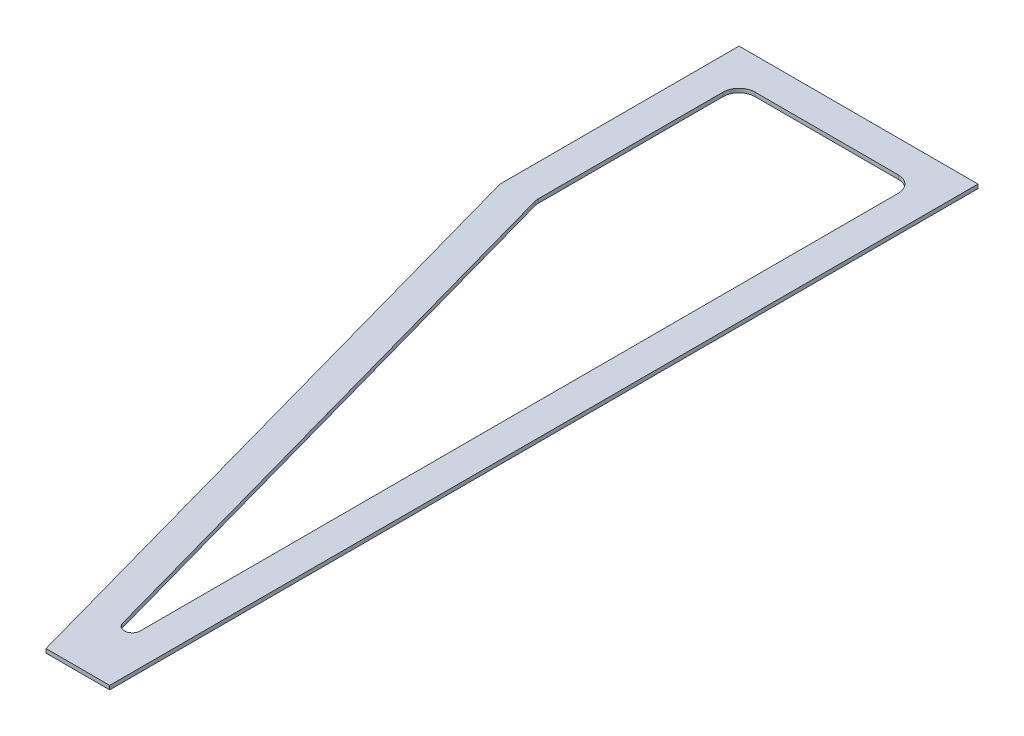
ISO-10303-21;
HEADER;
FILE_DESCRIPTION(('STEP AP214'),'2;1');
FILE_NAME('part.step','',(''),(''),'','','');
FILE_SCHEMA(('AUTOMOTIVE_DESIGN { 1 0 10303 214 1 1 1 1 }'));
ENDSEC;
DATA;
#1=APPLICATION_CONTEXT('core data for automotive mechanical design processes');
#2=APPLICATION_PROTOCOL_DEFINITION('international standard','automotive_design',2000,#1);
#3=PRODUCT_CONTEXT('',#1,'mechanical');
#4=PRODUCT('Part','Part','',(#3));
#5=PRODUCT_RELATED_PRODUCT_CATEGORY('part','',(#4));
#6=PRODUCT_DEFINITION_FORMATION('','',#4);
#7=PRODUCT_DEFINITION_CONTEXT('part definition',#1,'design');
#8=PRODUCT_DEFINITION('design','',#6,#7);
#9=PRODUCT_DEFINITION_SHAPE('','',#8);
#10=(LENGTH_UNIT() NAMED_UNIT(*) SI_UNIT(.MILLI.,.METRE.));
#11=(NAMED_UNIT(*) PLANE_ANGLE_UNIT() SI_UNIT($,.RADIAN.));
#12=(NAMED_UNIT(*) SI_UNIT($,.STERADIAN.) SOLID_ANGLE_UNIT());
#13=UNCERTAINTY_MEASURE_WITH_UNIT(LENGTH_MEASURE(1.E-05),#10,'distance_accuracy_value','');
#14=(GEOMETRIC_REPRESENTATION_CONTEXT(3) GLOBAL_UNCERTAINTY_ASSIGNED_CONTEXT((#13)) GLOBAL_UNIT_ASSIGNED_CONTEXT((#10,
#11,#12)) REPRESENTATION_CONTEXT('',''));
#15=CARTESIAN_POINT('',(0.,0.,0.));
#16=DIRECTION('',(0.,0.,1.));
#17=DIRECTION('',(1.,0.,0.));
#18=AXIS2_PLACEMENT_3D('',#15,#16,#17);
#19=CARTESIAN_POINT('',(0.,6.35,0.));
#20=DIRECTION('',(0.,-1.,0.));
#21=DIRECTION('',(0.,0.,-1.));
#22=AXIS2_PLACEMENT_3D('',#19,#20,#21);
#23=PLANE('',#22);
#24=DIRECTION('',(-1.,0.,0.));
#25=VECTOR('',#24,1.);
#26=CARTESIAN_POINT('',(-381.,6.35,0.));
#27=LINE('',#26,#25);
#28=CARTESIAN_POINT('',(0.,6.35,0.));
#29=VERTEX_POINT('',#28);
#30=CARTESIAN_POINT('',(-381.,6.35,0.));
#31=VERTEX_POINT('',#30);
#32=EDGE_CURVE('E226',#29,#31,#27,.T.);
#33=ORIENTED_EDGE('',*,*,#32,.T.);
#34=DIRECTION('',(0.,0.,1.));
#35=VECTOR('',#34,1.);
#36=CARTESIAN_POINT('',(-381.,6.35,0.));
#37=LINE('',#36,#35);
#38=CARTESIAN_POINT('',(-381.,6.35,381.));
#39=VERTEX_POINT('',#38);
#40=EDGE_CURVE('E230',#31,#39,#37,.T.);
#41=ORIENTED_EDGE('',*,*,#40,.T.);
#42=DIRECTION('',(0.268272734773865,0.,0.963343002142514));
#43=VECTOR('',#42,1.);
#44=CARTESIAN_POINT('',(-381.,6.35,381.));
#45=LINE('',#44,#43);
#46=CARTESIAN_POINT('',(-101.6,6.35,1384.3));
#47=VERTEX_POINT('',#46);
#48=EDGE_CURVE('E234',#39,#47,#45,.T.);
#49=ORIENTED_EDGE('',*,*,#48,.T.);
#50=DIRECTION('',(1.,0.,0.));
#51=VECTOR('',#50,1.);
#52=CARTESIAN_POINT('',(1.69527856405968E-13,6.35,1384.3));
#53=LINE('',#52,#51);
#54=CARTESIAN_POINT('',(1.69527856405968E-13,6.35,1384.3));
#55=VERTEX_POINT('',#54);
#56=EDGE_CURVE('E237',#47,#55,#53,.T.);
#57=ORIENTED_EDGE('',*,*,#56,.T.);
#58=DIRECTION('',(0.,0.,-1.));
#59=VECTOR('',#58,1.);
#60=CARTESIAN_POINT('',(0.,6.35,0.));
#61=LINE('',#60,#59);
#62=EDGE_CURVE('E240',#55,#29,#61,.T.);
#63=ORIENTED_EDGE('',*,*,#62,.T.);
#64=EDGE_LOOP('',(#33,#41,#49,#57,#63));
#65=FACE_BOUND('',#64,.T.);
#66=CARTESIAN_POINT('',(-76.2,6.35,76.2));
#67=DIRECTION('',(0.,1.,0.));
#68=DIRECTION('',(0.,0.,1.));
#69=AXIS2_PLACEMENT_3D('',#66,#67,#68);
#70=CIRCLE('',#69,25.4);
#71=CARTESIAN_POINT('',(-50.8,6.35,76.2));
#72=VERTEX_POINT('',#71);
#73=CARTESIAN_POINT('',(-76.2,6.35,50.8));
#74=VERTEX_POINT('',#73);
#75=EDGE_CURVE('E137',#72,#74,#70,.T.);
#76=ORIENTED_EDGE('',*,*,#75,.F.);
#77=DIRECTION('',(0.,0.,-1.));
#78=VECTOR('',#77,1.);
#79=CARTESIAN_POINT('',(-50.8,6.35,76.2));
#80=LINE('',#79,#78);
#81=CARTESIAN_POINT('',(-50.7999999999998,6.35,1286.01994621782));
#82=VERTEX_POINT('',#81);
#83=EDGE_CURVE('E178',#82,#72,#80,.T.);
#84=ORIENTED_EDGE('',*,*,#83,.F.);
#85=CARTESIAN_POINT('',(-63.4385773015515,6.35,1284.77240311528));
#86=DIRECTION('',(0.,1.,0.));
#87=DIRECTION('',(0.,0.,1.));
#88=AXIS2_PLACEMENT_3D('',#85,#86,#87);
#89=CIRCLE('',#88,12.7);
#90=CARTESIAN_POINT('',(-75.3778650917579,6.35,1289.10176878043));
#91=VERTEX_POINT('',#90);
#92=EDGE_CURVE('E175',#91,#82,#89,.T.);
#93=ORIENTED_EDGE('',*,*,#92,.F.);
#94=DIRECTION('',(0.268272734773865,0.,0.963343002142514));
#95=VECTOR('',#94,1.);
#96=CARTESIAN_POINT('',(-329.26891225442,6.35,377.402099423601));
#97=LINE('',#96,#95);
#98=CARTESIAN_POINT('',(-329.26891225442,6.35,377.402099423601));
#99=VERTEX_POINT('',#98);
#100=EDGE_CURVE('E172',#99,#91,#97,.T.);
#101=ORIENTED_EDGE('',*,*,#100,.F.);
#102=CARTESIAN_POINT('',(-304.8,6.35,370.587971960345));
#103=DIRECTION('',(0.,1.,0.));
#104=DIRECTION('',(0.,0.,-1.));
#105=AXIS2_PLACEMENT_3D('',#102,#103,#104);
#106=CIRCLE('',#105,25.4);
#107=CARTESIAN_POINT('',(-330.2,6.35,370.587971960345));
#108=VERTEX_POINT('',#107);
#109=EDGE_CURVE('E169',#108,#99,#106,.T.);
#110=ORIENTED_EDGE('',*,*,#109,.F.);
#111=DIRECTION('',(0.,0.,1.));
#112=VECTOR('',#111,1.);
#113=CARTESIAN_POINT('',(-330.2,6.35,76.2));
#114=LINE('',#113,#112);
#115=CARTESIAN_POINT('',(-330.2,6.35,76.2));
#116=VERTEX_POINT('',#115);
#117=EDGE_CURVE('E164',#116,#108,#114,.T.);
#118=ORIENTED_EDGE('',*,*,#117,.F.);
#119=CARTESIAN_POINT('',(-304.8,6.35,76.2));
#120=DIRECTION('',(0.,1.,0.));
#121=DIRECTION('',(0.,0.,1.));
#122=AXIS2_PLACEMENT_3D('',#119,#120,#121);
#123=CIRCLE('',#122,25.4);
#124=CARTESIAN_POINT('',(-304.8,6.35,50.8));
#125=VERTEX_POINT('',#124);
#126=EDGE_CURVE('E160',#125,#116,#123,.T.);
#127=ORIENTED_EDGE('',*,*,#126,.F.);
#128=DIRECTION('',(-1.,0.,0.));
#129=VECTOR('',#128,1.);
#130=CARTESIAN_POINT('',(-304.8,6.35,50.8));
#131=LINE('',#130,#129);
#132=EDGE_CURVE('E146',#74,#125,#131,.T.);
#133=ORIENTED_EDGE('',*,*,#132,.F.);
#134=EDGE_LOOP('',(#76,#84,#93,#101,#110,#118,#127,#133));
#135=FACE_BOUND('',#134,.T.);
#136=ADVANCED_FACE('F41',(#65,#135),#23,.F.);
#137=CARTESIAN_POINT('',(0.,0.,0.));
#138=DIRECTION('',(0.,-1.,0.));
#139=DIRECTION('',(0.,0.,-1.));
#140=AXIS2_PLACEMENT_3D('',#137,#138,#139);
#141=PLANE('',#140);
#142=DIRECTION('',(-1.,0.,0.));
#143=VECTOR('',#142,1.);
#144=CARTESIAN_POINT('',(-381.,0.,0.));
#145=LINE('',#144,#143);
#146=CARTESIAN_POINT('',(0.,0.,0.));
#147=VERTEX_POINT('',#146);
#148=CARTESIAN_POINT('',(-381.,0.,0.));
#149=VERTEX_POINT('',#148);
#150=EDGE_CURVE('E155',#147,#149,#145,.T.);
#151=ORIENTED_EDGE('',*,*,#150,.F.);
#152=DIRECTION('',(0.,0.,-1.));
#153=VECTOR('',#152,1.);
#154=CARTESIAN_POINT('',(0.,0.,0.));
#155=LINE('',#154,#153);
#156=CARTESIAN_POINT('',(1.69527856405968E-13,0.,1384.3));
#157=VERTEX_POINT('',#156);
#158=EDGE_CURVE('E231',#157,#147,#155,.T.);
#159=ORIENTED_EDGE('',*,*,#158,.F.);
#160=DIRECTION('',(1.,0.,0.));
#161=VECTOR('',#160,1.);
#162=CARTESIAN_POINT('',(1.69527856405968E-13,0.,1384.3));
#163=LINE('',#162,#161);
#164=CARTESIAN_POINT('',(-101.6,0.,1384.3));
#165=VERTEX_POINT('',#164);
#166=EDGE_CURVE('E253',#165,#157,#163,.T.);
#167=ORIENTED_EDGE('',*,*,#166,.F.);
#168=DIRECTION('',(0.268272734773865,0.,0.963343002142514));
#169=VECTOR('',#168,1.);
#170=CARTESIAN_POINT('',(-381.,0.,381.));
#171=LINE('',#170,#169);
#172=CARTESIAN_POINT('',(-381.,0.,381.));
#173=VERTEX_POINT('',#172);
#174=EDGE_CURVE('E250',#173,#165,#171,.T.);
#175=ORIENTED_EDGE('',*,*,#174,.F.);
#176=DIRECTION('',(0.,0.,1.));
#177=VECTOR('',#176,1.);
#178=CARTESIAN_POINT('',(-381.,0.,0.));
#179=LINE('',#178,#177);
#180=EDGE_CURVE('E247',#149,#173,#179,.T.);
#181=ORIENTED_EDGE('',*,*,#180,.F.);
#182=EDGE_LOOP('',(#151,#159,#167,#175,#181));
#183=FACE_BOUND('',#182,.T.);
#184=DIRECTION('',(0.,0.,-1.));
#185=VECTOR('',#184,1.);
#186=CARTESIAN_POINT('',(-50.8,0.,76.2));
#187=LINE('',#186,#185);
#188=CARTESIAN_POINT('',(-50.7999999999998,0.,1286.01994621782));
#189=VERTEX_POINT('',#188);
#190=CARTESIAN_POINT('',(-50.8,0.,76.2));
#191=VERTEX_POINT('',#190);
#192=EDGE_CURVE('E147',#189,#191,#187,.T.);
#193=ORIENTED_EDGE('',*,*,#192,.T.);
#194=CARTESIAN_POINT('',(-76.2,0.,76.2));
#195=DIRECTION('',(0.,1.,0.));
#196=DIRECTION('',(0.,0.,1.));
#197=AXIS2_PLACEMENT_3D('',#194,#195,#196);
#198=CIRCLE('',#197,25.4);
#199=CARTESIAN_POINT('',(-76.2,0.,50.8));
#200=VERTEX_POINT('',#199);
#201=EDGE_CURVE('E65',#191,#200,#198,.T.);
#202=ORIENTED_EDGE('',*,*,#201,.T.);
#203=DIRECTION('',(-1.,0.,0.));
#204=VECTOR('',#203,1.);
#205=CARTESIAN_POINT('',(-304.8,0.,50.8));
#206=LINE('',#205,#204);
#207=CARTESIAN_POINT('',(-304.8,0.,50.8));
#208=VERTEX_POINT('',#207);
#209=EDGE_CURVE('E153',#200,#208,#206,.T.);
#210=ORIENTED_EDGE('',*,*,#209,.T.);
#211=CARTESIAN_POINT('',(-304.8,0.,76.2));
#212=DIRECTION('',(0.,1.,0.));
#213=DIRECTION('',(0.,0.,1.));
#214=AXIS2_PLACEMENT_3D('',#211,#212,#213);
#215=CIRCLE('',#214,25.4);
#216=CARTESIAN_POINT('',(-330.2,0.,76.2));
#217=VERTEX_POINT('',#216);
#218=EDGE_CURVE('E185',#208,#217,#215,.T.);
#219=ORIENTED_EDGE('',*,*,#218,.T.);
#220=DIRECTION('',(0.,0.,1.));
#221=VECTOR('',#220,1.);
#222=CARTESIAN_POINT('',(-330.2,0.,76.2));
#223=LINE('',#222,#221);
#224=CARTESIAN_POINT('',(-330.2,0.,370.587971960345));
#225=VERTEX_POINT('',#224);
#226=EDGE_CURVE('E189',#217,#225,#223,.T.);
#227=ORIENTED_EDGE('',*,*,#226,.T.);
#228=CARTESIAN_POINT('',(-304.8,0.,370.587971960345));
#229=DIRECTION('',(0.,1.,0.));
#230=DIRECTION('',(0.,0.,-1.));
#231=AXIS2_PLACEMENT_3D('',#228,#229,#230);
#232=CIRCLE('',#231,25.4);
#233=CARTESIAN_POINT('',(-329.26891225442,0.,377.402099423601));
#234=VERTEX_POINT('',#233);
#235=EDGE_CURVE('E193',#225,#234,#232,.T.);
#236=ORIENTED_EDGE('',*,*,#235,.T.);
#237=DIRECTION('',(0.268272734773865,0.,0.963343002142514));
#238=VECTOR('',#237,1.);
#239=CARTESIAN_POINT('',(-329.26891225442,0.,377.402099423601));
#240=LINE('',#239,#238);
#241=CARTESIAN_POINT('',(-75.3778650917579,0.,1289.10176878043));
#242=VERTEX_POINT('',#241);
#243=EDGE_CURVE('E197',#234,#242,#240,.T.);
#244=ORIENTED_EDGE('',*,*,#243,.T.);
#245=CARTESIAN_POINT('',(-63.4385773015515,0.,1284.77240311528));
#246=DIRECTION('',(0.,1.,0.));
#247=DIRECTION('',(0.,0.,1.));
#248=AXIS2_PLACEMENT_3D('',#245,#246,#247);
#249=CIRCLE('',#248,12.7);
#250=EDGE_CURVE('E201',#242,#189,#249,.T.);
#251=ORIENTED_EDGE('',*,*,#250,.T.);
#252=EDGE_LOOP('',(#193,#202,#210,#219,#227,#236,#244,#251));
#253=FACE_BOUND('',#252,.T.);
#254=ADVANCED_FACE('F280',(#183,#253),#141,.T.);
#255=CARTESIAN_POINT('',(-381.,6.35,0.));
#256=DIRECTION('',(0.,0.,1.));
#257=DIRECTION('',(1.,0.,0.));
#258=AXIS2_PLACEMENT_3D('',#255,#256,#257);
#259=PLANE('',#258);
#260=ORIENTED_EDGE('',*,*,#150,.T.);
#261=DIRECTION('',(0.,-1.,0.));
#262=VECTOR('',#261,1.);
#263=CARTESIAN_POINT('',(-381.,6.35,0.));
#264=LINE('',#263,#262);
#265=EDGE_CURVE('E11',#31,#149,#264,.T.);
#266=ORIENTED_EDGE('',*,*,#265,.F.);
#267=ORIENTED_EDGE('',*,*,#32,.F.);
#268=DIRECTION('',(0.,-1.,0.));
#269=VECTOR('',#268,1.);
#270=CARTESIAN_POINT('',(0.,6.35,0.));
#271=LINE('',#270,#269);
#272=EDGE_CURVE('E243',#29,#147,#271,.T.);
#273=ORIENTED_EDGE('',*,*,#272,.T.);
#274=EDGE_LOOP('',(#260,#266,#267,#273));
#275=FACE_BOUND('',#274,.T.);
#276=ADVANCED_FACE('F43',(#275),#259,.F.);
#277=CARTESIAN_POINT('',(-381.,6.35,0.));
#278=DIRECTION('',(1.,0.,0.));
#279=DIRECTION('',(0.,0.,-1.));
#280=AXIS2_PLACEMENT_3D('',#277,#278,#279);
#281=PLANE('',#280);
#282=ORIENTED_EDGE('',*,*,#180,.T.);
#283=DIRECTION('',(0.,-1.,0.));
#284=VECTOR('',#283,1.);
#285=CARTESIAN_POINT('',(-381.,6.35,381.));
#286=LINE('',#285,#284);
#287=EDGE_CURVE('E50',#39,#173,#286,.T.);
#288=ORIENTED_EDGE('',*,*,#287,.F.);
#289=ORIENTED_EDGE('',*,*,#40,.F.);
#290=ORIENTED_EDGE('',*,*,#265,.T.);
#291=EDGE_LOOP('',(#282,#288,#289,#290));
#292=FACE_BOUND('',#291,.T.);
#293=ADVANCED_FACE('F294',(#292),#281,.F.);
#294=CARTESIAN_POINT('',(-381.,6.35,381.));
#295=DIRECTION('',(0.963343002142514,0.,-0.268272734773865));
#296=DIRECTION('',(-0.268272734773865,0.,-0.963343002142514));
#297=AXIS2_PLACEMENT_3D('',#294,#295,#296);
#298=PLANE('',#297);
#299=ORIENTED_EDGE('',*,*,#174,.T.);
#300=DIRECTION('',(0.,-1.,0.));
#301=VECTOR('',#300,1.);
#302=CARTESIAN_POINT('',(-101.6,6.35,1384.3));
#303=LINE('',#302,#301);
#304=EDGE_CURVE('E265',#47,#165,#303,.T.);
#305=ORIENTED_EDGE('',*,*,#304,.F.);
#306=ORIENTED_EDGE('',*,*,#48,.F.);
#307=ORIENTED_EDGE('',*,*,#287,.T.);
#308=EDGE_LOOP('',(#299,#305,#306,#307));
#309=FACE_BOUND('',#308,.T.);
#310=ADVANCED_FACE('F274',(#309),#298,.F.);
#311=CARTESIAN_POINT('',(1.69527856405968E-13,6.35,1384.3));
#312=DIRECTION('',(0.,0.,-1.));
#313=DIRECTION('',(-1.,0.,0.));
#314=AXIS2_PLACEMENT_3D('',#311,#312,#313);
#315=PLANE('',#314);
#316=ORIENTED_EDGE('',*,*,#166,.T.);
#317=DIRECTION('',(0.,-1.,0.));
#318=VECTOR('',#317,1.);
#319=CARTESIAN_POINT('',(1.69527856405968E-13,6.35,1384.3));
#320=LINE('',#319,#318);
#321=EDGE_CURVE('E261',#55,#157,#320,.T.);
#322=ORIENTED_EDGE('',*,*,#321,.F.);
#323=ORIENTED_EDGE('',*,*,#56,.F.);
#324=ORIENTED_EDGE('',*,*,#304,.T.);
#325=EDGE_LOOP('',(#316,#322,#323,#324));
#326=FACE_BOUND('',#325,.T.);
#327=ADVANCED_FACE('F285',(#326),#315,.F.);
#328=CARTESIAN_POINT('',(0.,6.35,0.));
#329=DIRECTION('',(-1.,0.,0.));
#330=DIRECTION('',(0.,0.,1.));
#331=AXIS2_PLACEMENT_3D('',#328,#329,#330);
#332=PLANE('',#331);
#333=ORIENTED_EDGE('',*,*,#158,.T.);
#334=ORIENTED_EDGE('',*,*,#272,.F.);
#335=ORIENTED_EDGE('',*,*,#62,.F.);
#336=ORIENTED_EDGE('',*,*,#321,.T.);
#337=EDGE_LOOP('',(#333,#334,#335,#336));
#338=FACE_BOUND('',#337,.T.);
#339=ADVANCED_FACE('F289',(#338),#332,.F.);
#340=CARTESIAN_POINT('',(-76.2,6.35,76.2));
#341=DIRECTION('',(0.,-1.,0.));
#342=DIRECTION('',(0.,0.,-1.));
#343=AXIS2_PLACEMENT_3D('',#340,#341,#342);
#344=CYLINDRICAL_SURFACE('',#343,25.4);
#345=ORIENTED_EDGE('',*,*,#201,.F.);
#346=DIRECTION('',(0.,-1.,0.));
#347=VECTOR('',#346,1.);
#348=CARTESIAN_POINT('',(-50.8,6.35,76.2));
#349=LINE('',#348,#347);
#350=EDGE_CURVE('E141',#72,#191,#349,.T.);
#351=ORIENTED_EDGE('',*,*,#350,.F.);
#352=ORIENTED_EDGE('',*,*,#75,.T.);
#353=DIRECTION('',(0.,-1.,0.));
#354=VECTOR('',#353,1.);
#355=CARTESIAN_POINT('',(-76.2,6.35,50.8));
#356=LINE('',#355,#354);
#357=EDGE_CURVE('E140',#74,#200,#356,.T.);
#358=ORIENTED_EDGE('',*,*,#357,.T.);
#359=EDGE_LOOP('',(#345,#351,#352,#358));
#360=FACE_BOUND('',#359,.T.);
#361=ADVANCED_FACE('F139',(#360),#344,.F.);
#362=CARTESIAN_POINT('',(-304.8,6.35,50.8));
#363=DIRECTION('',(0.,0.,1.));
#364=DIRECTION('',(1.,0.,0.));
#365=AXIS2_PLACEMENT_3D('',#362,#363,#364);
#366=PLANE('',#365);
#367=ORIENTED_EDGE('',*,*,#209,.F.);
#368=ORIENTED_EDGE('',*,*,#357,.F.);
#369=ORIENTED_EDGE('',*,*,#132,.T.);
#370=DIRECTION('',(0.,-1.,0.));
#371=VECTOR('',#370,1.);
#372=CARTESIAN_POINT('',(-304.8,6.35,50.8));
#373=LINE('',#372,#371);
#374=EDGE_CURVE('E156',#125,#208,#373,.T.);
#375=ORIENTED_EDGE('',*,*,#374,.T.);
#376=EDGE_LOOP('',(#367,#368,#369,#375));
#377=FACE_BOUND('',#376,.T.);
#378=ADVANCED_FACE('F150',(#377),#366,.T.);
#379=CARTESIAN_POINT('',(-304.8,6.35,76.2));
#380=DIRECTION('',(0.,-1.,0.));
#381=DIRECTION('',(0.,0.,-1.));
#382=AXIS2_PLACEMENT_3D('',#379,#380,#381);
#383=CYLINDRICAL_SURFACE('',#382,25.4);
#384=ORIENTED_EDGE('',*,*,#218,.F.);
#385=ORIENTED_EDGE('',*,*,#374,.F.);
#386=ORIENTED_EDGE('',*,*,#126,.T.);
#387=DIRECTION('',(0.,-1.,0.));
#388=VECTOR('',#387,1.);
#389=CARTESIAN_POINT('',(-330.2,6.35,76.2));
#390=LINE('',#389,#388);
#391=EDGE_CURVE('E221',#116,#217,#390,.T.);
#392=ORIENTED_EDGE('',*,*,#391,.T.);
#393=EDGE_LOOP('',(#384,#385,#386,#392));
#394=FACE_BOUND('',#393,.T.);
#395=ADVANCED_FACE('F337',(#394),#383,.F.);
#396=CARTESIAN_POINT('',(-330.2,6.35,76.2));
#397=DIRECTION('',(1.,0.,0.));
#398=DIRECTION('',(0.,0.,-1.));
#399=AXIS2_PLACEMENT_3D('',#396,#397,#398);
#400=PLANE('',#399);
#401=ORIENTED_EDGE('',*,*,#226,.F.);
#402=ORIENTED_EDGE('',*,*,#391,.F.);
#403=ORIENTED_EDGE('',*,*,#117,.T.);
#404=DIRECTION('',(0.,-1.,0.));
#405=VECTOR('',#404,1.);
#406=CARTESIAN_POINT('',(-330.2,6.35,370.587971960345));
#407=LINE('',#406,#405);
#408=EDGE_CURVE('E218',#108,#225,#407,.T.);
#409=ORIENTED_EDGE('',*,*,#408,.T.);
#410=EDGE_LOOP('',(#401,#402,#403,#409));
#411=FACE_BOUND('',#410,.T.);
#412=ADVANCED_FACE('F343',(#411),#400,.T.);
#413=CARTESIAN_POINT('',(-304.8,6.35,370.587971960345));
#414=DIRECTION('',(0.,-1.,0.));
#415=DIRECTION('',(0.,0.,-1.));
#416=AXIS2_PLACEMENT_3D('',#413,#414,#415);
#417=CYLINDRICAL_SURFACE('',#416,25.4);
#418=ORIENTED_EDGE('',*,*,#235,.F.);
#419=ORIENTED_EDGE('',*,*,#408,.F.);
#420=ORIENTED_EDGE('',*,*,#109,.T.);
#421=DIRECTION('',(0.,-1.,0.));
#422=VECTOR('',#421,1.);
#423=CARTESIAN_POINT('',(-329.26891225442,6.35,377.402099423601));
#424=LINE('',#423,#422);
#425=EDGE_CURVE('E215',#99,#234,#424,.T.);
#426=ORIENTED_EDGE('',*,*,#425,.T.);
#427=EDGE_LOOP('',(#418,#419,#420,#426));
#428=FACE_BOUND('',#427,.T.);
#429=ADVANCED_FACE('F351',(#428),#417,.F.);
#430=CARTESIAN_POINT('',(-329.26891225442,6.35,377.402099423601));
#431=DIRECTION('',(0.963343002142514,0.,-0.268272734773865));
#432=DIRECTION('',(-0.268272734773865,0.,-0.963343002142514));
#433=AXIS2_PLACEMENT_3D('',#430,#431,#432);
#434=PLANE('',#433);
#435=ORIENTED_EDGE('',*,*,#243,.F.);
#436=ORIENTED_EDGE('',*,*,#425,.F.);
#437=ORIENTED_EDGE('',*,*,#100,.T.);
#438=DIRECTION('',(0.,-1.,0.));
#439=VECTOR('',#438,1.);
#440=CARTESIAN_POINT('',(-75.3778650917579,6.35,1289.10176878043));
#441=LINE('',#440,#439);
#442=EDGE_CURVE('E212',#91,#242,#441,.T.);
#443=ORIENTED_EDGE('',*,*,#442,.T.);
#444=EDGE_LOOP('',(#435,#436,#437,#443));
#445=FACE_BOUND('',#444,.T.);
#446=ADVANCED_FACE('F359',(#445),#434,.T.);
#447=CARTESIAN_POINT('',(-63.4385773015515,6.35,1284.77240311528));
#448=DIRECTION('',(0.,-1.,0.));
#449=DIRECTION('',(0.,0.,-1.));
#450=AXIS2_PLACEMENT_3D('',#447,#448,#449);
#451=CYLINDRICAL_SURFACE('',#450,12.7);
#452=ORIENTED_EDGE('',*,*,#250,.F.);
#453=ORIENTED_EDGE('',*,*,#442,.F.);
#454=ORIENTED_EDGE('',*,*,#92,.T.);
#455=DIRECTION('',(0.,-1.,0.));
#456=VECTOR('',#455,1.);
#457=CARTESIAN_POINT('',(-50.7999999999998,6.35,1286.01994621782));
#458=LINE('',#457,#456);
#459=EDGE_CURVE('E57',#82,#189,#458,.T.);
#460=ORIENTED_EDGE('',*,*,#459,.T.);
#461=EDGE_LOOP('',(#452,#453,#454,#460));
#462=FACE_BOUND('',#461,.T.);
#463=ADVANCED_FACE('F367',(#462),#451,.F.);
#464=CARTESIAN_POINT('',(-50.8,6.35,76.2));
#465=DIRECTION('',(-1.,0.,0.));
#466=DIRECTION('',(0.,0.,1.));
#467=AXIS2_PLACEMENT_3D('',#464,#465,#466);
#468=PLANE('',#467);
#469=ORIENTED_EDGE('',*,*,#192,.F.);
#470=ORIENTED_EDGE('',*,*,#459,.F.);
#471=ORIENTED_EDGE('',*,*,#83,.T.);
#472=ORIENTED_EDGE('',*,*,#350,.T.);
#473=EDGE_LOOP('',(#469,#470,#471,#472));
#474=FACE_BOUND('',#473,.T.);
#475=ADVANCED_FACE('F375',(#474),#468,.T.);
#476=CLOSED_SHELL('',(#136,#254,#276,#293,#310,#327,#339,#361,#378,#395,#412,#429,#446,#463,#475));
#477=MANIFOLD_SOLID_BREP('B2',#476);
#478=ADVANCED_BREP_SHAPE_REPRESENTATION('',(#18,#477),#14);
#479=SHAPE_DEFINITION_REPRESENTATION(#9,#478);
ENDSEC;
END-ISO-10303-21;
